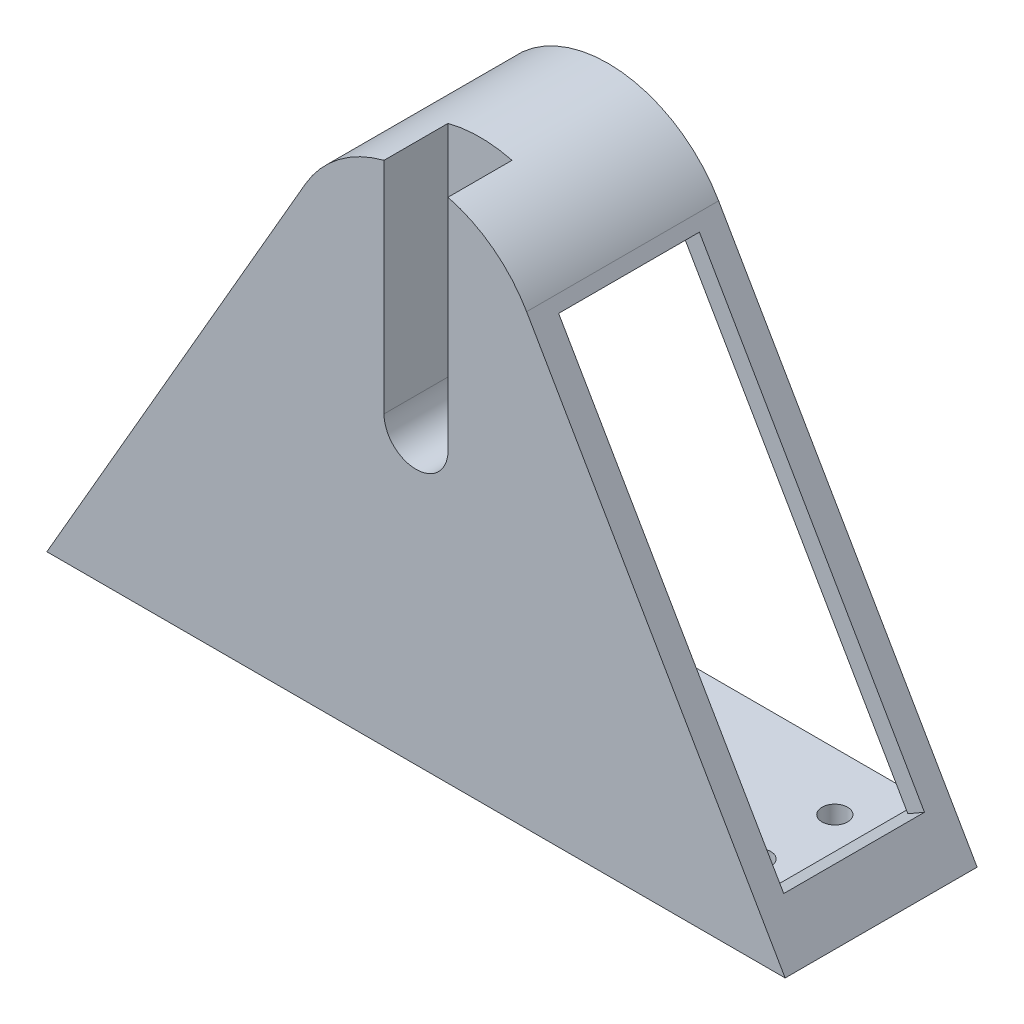
ISO-10303-21;
HEADER;
FILE_DESCRIPTION(('STEP AP214'),'2;1');
FILE_NAME('part.step','',(''),(''),'','','');
FILE_SCHEMA(('AUTOMOTIVE_DESIGN { 1 0 10303 214 1 1 1 1 }'));
ENDSEC;
DATA;
#1=APPLICATION_CONTEXT('core data for automotive mechanical design processes');
#2=APPLICATION_PROTOCOL_DEFINITION('international standard','automotive_design',2000,#1);
#3=PRODUCT_CONTEXT('',#1,'mechanical');
#4=PRODUCT('Part','Part','',(#3));
#5=PRODUCT_RELATED_PRODUCT_CATEGORY('part','',(#4));
#6=PRODUCT_DEFINITION_FORMATION('','',#4);
#7=PRODUCT_DEFINITION_CONTEXT('part definition',#1,'design');
#8=PRODUCT_DEFINITION('design','',#6,#7);
#9=PRODUCT_DEFINITION_SHAPE('','',#8);
#10=(LENGTH_UNIT() NAMED_UNIT(*) SI_UNIT(.MILLI.,.METRE.));
#11=(NAMED_UNIT(*) PLANE_ANGLE_UNIT() SI_UNIT($,.RADIAN.));
#12=(NAMED_UNIT(*) SI_UNIT($,.STERADIAN.) SOLID_ANGLE_UNIT());
#13=UNCERTAINTY_MEASURE_WITH_UNIT(LENGTH_MEASURE(1.E-05),#10,'distance_accuracy_value','');
#14=(GEOMETRIC_REPRESENTATION_CONTEXT(3) GLOBAL_UNCERTAINTY_ASSIGNED_CONTEXT((#13)) GLOBAL_UNIT_ASSIGNED_CONTEXT((#10,
#11,#12)) REPRESENTATION_CONTEXT('',''));
#15=CARTESIAN_POINT('',(0.,0.,0.));
#16=DIRECTION('',(0.,0.,1.));
#17=DIRECTION('',(1.,0.,0.));
#18=AXIS2_PLACEMENT_3D('',#15,#16,#17);
#19=CARTESIAN_POINT('',(0.,65.,-122.8));
#20=DIRECTION('',(0.,-1.,0.));
#21=DIRECTION('',(0.,0.,-1.));
#22=AXIS2_PLACEMENT_3D('',#19,#20,#21);
#23=PLANE('',#22);
#24=CARTESIAN_POINT('',(144.450852961086,65.,-139.8));
#25=DIRECTION('',(0.,1.,0.));
#26=DIRECTION('',(0.,0.,1.));
#27=AXIS2_PLACEMENT_3D('',#24,#25,#26);
#28=CIRCLE('',#27,2.);
#29=CARTESIAN_POINT('',(144.450852961086,65.,-137.8));
#30=VERTEX_POINT('',#29);
#31=EDGE_CURVE('E276',#30,#30,#28,.T.);
#32=ORIENTED_EDGE('',*,*,#31,.F.);
#33=EDGE_LOOP('',(#32));
#34=FACE_BOUND('',#33,.T.);
#35=CARTESIAN_POINT('',(144.450852961086,65.,-127.8));
#36=DIRECTION('',(0.,1.,0.));
#37=DIRECTION('',(0.,0.,1.));
#38=AXIS2_PLACEMENT_3D('',#35,#36,#37);
#39=CIRCLE('',#38,2.);
#40=CARTESIAN_POINT('',(144.450852961086,65.,-125.8));
#41=VERTEX_POINT('',#40);
#42=EDGE_CURVE('E262',#41,#41,#39,.T.);
#43=ORIENTED_EDGE('',*,*,#42,.F.);
#44=EDGE_LOOP('',(#43));
#45=FACE_BOUND('',#44,.T.);
#46=CARTESIAN_POINT('',(55.4902217167998,65.,-127.8));
#47=DIRECTION('',(0.,1.,0.));
#48=DIRECTION('',(0.,0.,1.));
#49=AXIS2_PLACEMENT_3D('',#46,#47,#48);
#50=CIRCLE('',#49,2.);
#51=CARTESIAN_POINT('',(55.4902217167998,65.,-125.8));
#52=VERTEX_POINT('',#51);
#53=EDGE_CURVE('E261',#52,#52,#50,.T.);
#54=ORIENTED_EDGE('',*,*,#53,.F.);
#55=EDGE_LOOP('',(#54));
#56=FACE_BOUND('',#55,.T.);
#57=CARTESIAN_POINT('',(55.4902217167998,65.,-139.8));
#58=DIRECTION('',(0.,1.,0.));
#59=DIRECTION('',(0.,0.,1.));
#60=AXIS2_PLACEMENT_3D('',#57,#58,#59);
#61=CIRCLE('',#60,2.);
#62=CARTESIAN_POINT('',(55.4902217167998,65.,-137.8));
#63=VERTEX_POINT('',#62);
#64=EDGE_CURVE('E282',#63,#63,#61,.T.);
#65=ORIENTED_EDGE('',*,*,#64,.F.);
#66=EDGE_LOOP('',(#65));
#67=FACE_BOUND('',#66,.T.);
#68=DIRECTION('',(0.,0.,1.));
#69=VECTOR('',#68,1.);
#70=CARTESIAN_POINT('',(149.450852961086,65.,-148.8));
#71=LINE('',#70,#69);
#72=CARTESIAN_POINT('',(149.450852961086,65.,-148.8));
#73=VERTEX_POINT('',#72);
#74=CARTESIAN_POINT('',(149.450852961086,65.,-122.8));
#75=VERTEX_POINT('',#74);
#76=EDGE_CURVE('E233',#73,#75,#71,.T.);
#77=ORIENTED_EDGE('',*,*,#76,.F.);
#78=DIRECTION('',(-1.,0.,0.));
#79=VECTOR('',#78,1.);
#80=CARTESIAN_POINT('',(0.,65.,-148.8));
#81=LINE('',#80,#79);
#82=CARTESIAN_POINT('',(50.4902217167998,65.,-148.8));
#83=VERTEX_POINT('',#82);
#84=EDGE_CURVE('E290',#73,#83,#81,.T.);
#85=ORIENTED_EDGE('',*,*,#84,.T.);
#86=DIRECTION('',(0.,0.,1.));
#87=VECTOR('',#86,1.);
#88=CARTESIAN_POINT('',(50.4902217167998,65.,-148.8));
#89=LINE('',#88,#87);
#90=CARTESIAN_POINT('',(50.4902217167998,65.,-122.8));
#91=VERTEX_POINT('',#90);
#92=EDGE_CURVE('E236',#83,#91,#89,.T.);
#93=ORIENTED_EDGE('',*,*,#92,.T.);
#94=DIRECTION('',(-1.,0.,0.));
#95=VECTOR('',#94,1.);
#96=CARTESIAN_POINT('',(0.,65.,-122.8));
#97=LINE('',#96,#95);
#98=EDGE_CURVE('E219',#75,#91,#97,.T.);
#99=ORIENTED_EDGE('',*,*,#98,.F.);
#100=EDGE_LOOP('',(#77,#85,#93,#99));
#101=FACE_BOUND('',#100,.T.);
#102=ADVANCED_FACE('F40',(#34,#45,#56,#67,#101),#23,.F.);
#103=CARTESIAN_POINT('',(0.,0.,-122.8));
#104=DIRECTION('',(0.,0.,-1.));
#105=DIRECTION('',(-1.,0.,0.));
#106=AXIS2_PLACEMENT_3D('',#103,#104,#105);
#107=PLANE('',#106);
#108=DIRECTION('',(0.866025403784436,0.500000000000004,0.));
#109=VECTOR('',#108,1.);
#110=CARTESIAN_POINT('',(150.001497308104,65.3179146619785,-122.8));
#111=LINE('',#110,#109);
#112=CARTESIAN_POINT('',(153.465598923241,67.3179146619785,-122.8));
#113=VERTEX_POINT('',#112);
#114=EDGE_CURVE('E215',#75,#113,#111,.T.);
#115=ORIENTED_EDGE('',*,*,#114,.F.);
#116=ORIENTED_EDGE('',*,*,#98,.T.);
#117=DIRECTION('',(-0.86602540378444,0.499999999999998,0.));
#118=VECTOR('',#117,1.);
#119=CARTESIAN_POINT('',(49.9837713613677,65.2923992490399,-122.8));
#120=LINE('',#119,#118);
#121=CARTESIAN_POINT('',(46.5196697462299,67.2923992490399,-122.8));
#122=VERTEX_POINT('',#121);
#123=EDGE_CURVE('E238',#91,#122,#120,.T.);
#124=ORIENTED_EDGE('',*,*,#123,.T.);
#125=DIRECTION('',(-0.499999999999998,-0.86602540378444,0.));
#126=VECTOR('',#125,1.);
#127=CARTESIAN_POINT('',(5.7512886940359,-3.32050807568886,-122.8));
#128=LINE('',#127,#126);
#129=CARTESIAN_POINT('',(80.7128129211017,126.516660498395,-122.8));
#130=VERTEX_POINT('',#129);
#131=EDGE_CURVE('E418',#130,#122,#128,.T.);
#132=ORIENTED_EDGE('',*,*,#131,.F.);
#133=DIRECTION('',(-0.86602540378444,0.499999999999998,0.));
#134=VECTOR('',#133,1.);
#135=CARTESIAN_POINT('',(84.1769145362396,124.516660498395,-122.8));
#136=LINE('',#135,#134);
#137=CARTESIAN_POINT('',(83.3108891324551,125.016660498395,-122.8));
#138=VERTEX_POINT('',#137);
#139=EDGE_CURVE('E347',#138,#130,#136,.T.);
#140=ORIENTED_EDGE('',*,*,#139,.F.);
#141=DIRECTION('',(0.499999999999998,0.86602540378444,0.));
#142=VECTOR('',#141,1.);
#143=CARTESIAN_POINT('',(8.34936490538919,-4.82050807568884,-122.8));
#144=LINE('',#143,#142);
#145=CARTESIAN_POINT('',(85.3108891324551,128.480762113533,-122.8));
#146=VERTEX_POINT('',#145);
#147=EDGE_CURVE('E381',#138,#146,#144,.T.);
#148=ORIENTED_EDGE('',*,*,#147,.T.);
#149=CARTESIAN_POINT('',(99.9999999999996,120.,-122.8));
#150=DIRECTION('',(0.,0.,-1.));
#151=DIRECTION('',(-1.,0.,0.));
#152=AXIS2_PLACEMENT_3D('',#149,#150,#151);
#153=CIRCLE('',#152,16.9615242270662);
#154=CARTESIAN_POINT('',(90.,133.700120587256,-122.8));
#155=VERTEX_POINT('',#154);
#156=EDGE_CURVE('E376',#146,#155,#153,.T.);
#157=ORIENTED_EDGE('',*,*,#156,.T.);
#158=DIRECTION('',(0.823883853054496,0.566758675871907,0.));
#159=VECTOR('',#158,1.);
#160=CARTESIAN_POINT('',(90.,133.700120587256,-122.8));
#161=LINE('',#160,#159);
#162=CARTESIAN_POINT('',(93.,135.763853261846,-122.8));
#163=VERTEX_POINT('',#162);
#164=EDGE_CURVE('E380',#155,#163,#161,.T.);
#165=ORIENTED_EDGE('',*,*,#164,.T.);
#166=DIRECTION('',(0.,-1.,0.));
#167=VECTOR('',#166,1.);
#168=CARTESIAN_POINT('',(93.,105.,-122.8));
#169=LINE('',#168,#167);
#170=CARTESIAN_POINT('',(93.,105.,-122.8));
#171=VERTEX_POINT('',#170);
#172=EDGE_CURVE('E484',#163,#171,#169,.T.);
#173=ORIENTED_EDGE('',*,*,#172,.T.);
#174=CARTESIAN_POINT('',(100.,105.,-122.8));
#175=DIRECTION('',(0.,0.,1.));
#176=DIRECTION('',(-1.,0.,0.));
#177=AXIS2_PLACEMENT_3D('',#174,#175,#176);
#178=CIRCLE('',#177,7.00000000000001);
#179=CARTESIAN_POINT('',(107.,105.,-122.8));
#180=VERTEX_POINT('',#179);
#181=EDGE_CURVE('E492',#171,#180,#178,.T.);
#182=ORIENTED_EDGE('',*,*,#181,.T.);
#183=DIRECTION('',(0.,1.,0.));
#184=VECTOR('',#183,1.);
#185=CARTESIAN_POINT('',(107.,105.,-122.8));
#186=LINE('',#185,#184);
#187=CARTESIAN_POINT('',(107.,135.763853261846,-122.8));
#188=VERTEX_POINT('',#187);
#189=EDGE_CURVE('E488',#180,#188,#186,.T.);
#190=ORIENTED_EDGE('',*,*,#189,.T.);
#191=DIRECTION('',(0.823883853054429,-0.566758675872005,0.));
#192=VECTOR('',#191,1.);
#193=CARTESIAN_POINT('',(110.,133.700120587256,-122.8));
#194=LINE('',#193,#192);
#195=CARTESIAN_POINT('',(110.,133.700120587256,-122.8));
#196=VERTEX_POINT('',#195);
#197=EDGE_CURVE('E393',#188,#196,#194,.T.);
#198=ORIENTED_EDGE('',*,*,#197,.T.);
#199=CARTESIAN_POINT('',(99.9999999999996,120.,-122.8));
#200=DIRECTION('',(0.,0.,-1.));
#201=DIRECTION('',(-1.,0.,0.));
#202=AXIS2_PLACEMENT_3D('',#199,#200,#201);
#203=CIRCLE('',#202,16.9615242270662);
#204=CARTESIAN_POINT('',(114.689110867544,128.480762113533,-122.8));
#205=VERTEX_POINT('',#204);
#206=EDGE_CURVE('E389',#196,#205,#203,.T.);
#207=ORIENTED_EDGE('',*,*,#206,.T.);
#208=DIRECTION('',(0.500000000000004,-0.866025403784436,0.));
#209=VECTOR('',#208,1.);
#210=CARTESIAN_POINT('',(141.65063509461,81.7820323027557,-122.8));
#211=LINE('',#210,#209);
#212=CARTESIAN_POINT('',(115.689110867544,126.748711305964,-122.8));
#213=VERTEX_POINT('',#212);
#214=EDGE_CURVE('E384',#205,#213,#211,.T.);
#215=ORIENTED_EDGE('',*,*,#214,.T.);
#216=DIRECTION('',(0.866025403784436,0.500000000000004,0.));
#217=VECTOR('',#216,1.);
#218=CARTESIAN_POINT('',(114.82308546376,126.248711305964,-122.8));
#219=LINE('',#218,#217);
#220=CARTESIAN_POINT('',(118.287187078897,128.248711305964,-122.8));
#221=VERTEX_POINT('',#220);
#222=EDGE_CURVE('E388',#213,#221,#219,.T.);
#223=ORIENTED_EDGE('',*,*,#222,.T.);
#224=DIRECTION('',(0.500000000000004,-0.866025403784436,0.));
#225=VECTOR('',#224,1.);
#226=CARTESIAN_POINT('',(118.287187078897,128.248711305964,-122.8));
#227=LINE('',#226,#225);
#228=EDGE_CURVE('E222',#221,#113,#227,.T.);
#229=ORIENTED_EDGE('',*,*,#228,.T.);
#230=EDGE_LOOP('',(#115,#116,#124,#132,#140,#148,#157,#165,#173,#182,#190,#198,#207,#215,#223,#229));
#231=FACE_BOUND('',#230,.T.);
#232=ADVANCED_FACE('F217',(#231),#107,.T.);
#233=CARTESIAN_POINT('',(141.65063509461,81.7820323027557,-122.8));
#234=DIRECTION('',(0.866025403784436,0.500000000000004,0.));
#235=DIRECTION('',(-0.500000000000004,0.866025403784436,0.));
#236=AXIS2_PLACEMENT_3D('',#233,#234,#235);
#237=PLANE('',#236);
#238=DIRECTION('',(0.,0.,1.));
#239=VECTOR('',#238,1.);
#240=CARTESIAN_POINT('',(150.867522711888,65.8179146619785,-148.8));
#241=LINE('',#240,#239);
#242=CARTESIAN_POINT('',(150.867522711888,65.8179146619785,-148.8));
#243=VERTEX_POINT('',#242);
#244=CARTESIAN_POINT('',(150.867522711888,65.8179146619785,-144.8));
#245=VERTEX_POINT('',#244);
#246=EDGE_CURVE('E253',#243,#245,#241,.T.);
#247=ORIENTED_EDGE('',*,*,#246,.T.);
#248=DIRECTION('',(-0.500000000000004,0.866025403784436,0.));
#249=VECTOR('',#248,1.);
#250=CARTESIAN_POINT('',(141.65063509461,81.7820323027557,-144.8));
#251=LINE('',#250,#249);
#252=CARTESIAN_POINT('',(115.689110867544,126.748711305964,-144.8));
#253=VERTEX_POINT('',#252);
#254=EDGE_CURVE('E532',#245,#253,#251,.T.);
#255=ORIENTED_EDGE('',*,*,#254,.T.);
#256=DIRECTION('',(0.,0.,1.));
#257=VECTOR('',#256,1.);
#258=CARTESIAN_POINT('',(115.689110867544,126.748711305964,-122.8));
#259=LINE('',#258,#257);
#260=EDGE_CURVE('E353',#253,#213,#259,.T.);
#261=ORIENTED_EDGE('',*,*,#260,.T.);
#262=ORIENTED_EDGE('',*,*,#214,.F.);
#263=DIRECTION('',(0.,0.,-1.));
#264=VECTOR('',#263,1.);
#265=CARTESIAN_POINT('',(114.689110867544,128.480762113533,-122.8));
#266=LINE('',#265,#264);
#267=CARTESIAN_POINT('',(114.689110867544,128.480762113533,-148.8));
#268=VERTEX_POINT('',#267);
#269=EDGE_CURVE('E349',#205,#268,#266,.T.);
#270=ORIENTED_EDGE('',*,*,#269,.T.);
#271=DIRECTION('',(0.500000000000004,-0.866025403784436,0.));
#272=VECTOR('',#271,1.);
#273=CARTESIAN_POINT('',(141.65063509461,81.7820323027557,-148.8));
#274=LINE('',#273,#272);
#275=EDGE_CURVE('E352',#268,#243,#274,.T.);
#276=ORIENTED_EDGE('',*,*,#275,.T.);
#277=EDGE_LOOP('',(#247,#255,#261,#262,#270,#276));
#278=FACE_BOUND('',#277,.T.);
#279=ADVANCED_FACE('F553',(#278),#237,.F.);
#280=CARTESIAN_POINT('',(8.34936490538919,-4.82050807568884,-122.8));
#281=DIRECTION('',(-0.86602540378444,0.499999999999998,0.));
#282=DIRECTION('',(-0.499999999999998,-0.86602540378444,0.));
#283=AXIS2_PLACEMENT_3D('',#280,#281,#282);
#284=PLANE('',#283);
#285=DIRECTION('',(0.,0.,1.));
#286=VECTOR('',#285,1.);
#287=CARTESIAN_POINT('',(49.1177459575832,65.7923992490399,-148.8));
#288=LINE('',#287,#286);
#289=CARTESIAN_POINT('',(49.1177459575832,65.7923992490399,-148.8));
#290=VERTEX_POINT('',#289);
#291=CARTESIAN_POINT('',(49.1177459575832,65.7923992490399,-144.8));
#292=VERTEX_POINT('',#291);
#293=EDGE_CURVE('E448',#290,#292,#288,.T.);
#294=ORIENTED_EDGE('',*,*,#293,.F.);
#295=DIRECTION('',(0.499999999999998,0.86602540378444,0.));
#296=VECTOR('',#295,1.);
#297=CARTESIAN_POINT('',(8.34936490538919,-4.82050807568884,-148.8));
#298=LINE('',#297,#296);
#299=CARTESIAN_POINT('',(85.3108891324551,128.480762113533,-148.8));
#300=VERTEX_POINT('',#299);
#301=EDGE_CURVE('E366',#290,#300,#298,.T.);
#302=ORIENTED_EDGE('',*,*,#301,.T.);
#303=DIRECTION('',(0.,0.,-1.));
#304=VECTOR('',#303,1.);
#305=CARTESIAN_POINT('',(85.3108891324551,128.480762113533,-122.8));
#306=LINE('',#305,#304);
#307=EDGE_CURVE('E354',#146,#300,#306,.T.);
#308=ORIENTED_EDGE('',*,*,#307,.F.);
#309=ORIENTED_EDGE('',*,*,#147,.F.);
#310=DIRECTION('',(0.,0.,-1.));
#311=VECTOR('',#310,1.);
#312=CARTESIAN_POINT('',(83.3108891324551,125.016660498395,-122.8));
#313=LINE('',#312,#311);
#314=CARTESIAN_POINT('',(83.3108891324551,125.016660498395,-144.8));
#315=VERTEX_POINT('',#314);
#316=EDGE_CURVE('E308',#138,#315,#313,.T.);
#317=ORIENTED_EDGE('',*,*,#316,.T.);
#318=DIRECTION('',(-0.499999999999998,-0.86602540378444,0.));
#319=VECTOR('',#318,1.);
#320=CARTESIAN_POINT('',(8.34936490538919,-4.82050807568884,-144.8));
#321=LINE('',#320,#319);
#322=EDGE_CURVE('E257',#315,#292,#321,.T.);
#323=ORIENTED_EDGE('',*,*,#322,.T.);
#324=EDGE_LOOP('',(#294,#302,#308,#309,#317,#323));
#325=FACE_BOUND('',#324,.T.);
#326=ADVANCED_FACE('F586',(#325),#284,.F.);
#327=CARTESIAN_POINT('',(99.9999999999996,120.,-148.8));
#328=DIRECTION('',(0.,0.,1.));
#329=DIRECTION('',(1.,0.,0.));
#330=AXIS2_PLACEMENT_3D('',#327,#328,#329);
#331=PLANE('',#330);
#332=ORIENTED_EDGE('',*,*,#84,.F.);
#333=DIRECTION('',(0.866025403784424,0.500000000000025,0.));
#334=VECTOR('',#333,1.);
#335=CARTESIAN_POINT('',(150.867522711888,65.8179146619785,-148.8));
#336=LINE('',#335,#334);
#337=EDGE_CURVE('E244',#73,#243,#336,.T.);
#338=ORIENTED_EDGE('',*,*,#337,.T.);
#339=ORIENTED_EDGE('',*,*,#275,.F.);
#340=CARTESIAN_POINT('',(99.9999999999996,120.,-148.8));
#341=DIRECTION('',(0.,0.,-1.));
#342=DIRECTION('',(-1.,0.,0.));
#343=AXIS2_PLACEMENT_3D('',#340,#341,#342);
#344=CIRCLE('',#343,16.9615242270662);
#345=CARTESIAN_POINT('',(110.,133.700120587256,-148.8));
#346=VERTEX_POINT('',#345);
#347=EDGE_CURVE('E348',#346,#268,#344,.T.);
#348=ORIENTED_EDGE('',*,*,#347,.F.);
#349=DIRECTION('',(0.823883853054429,-0.566758675872005,0.));
#350=VECTOR('',#349,1.);
#351=CARTESIAN_POINT('',(110.,133.700120587256,-148.8));
#352=LINE('',#351,#350);
#353=CARTESIAN_POINT('',(107.,135.763853261846,-148.8));
#354=VERTEX_POINT('',#353);
#355=EDGE_CURVE('E361',#354,#346,#352,.T.);
#356=ORIENTED_EDGE('',*,*,#355,.F.);
#357=CARTESIAN_POINT('',(99.9999999999996,120.,-148.8));
#358=DIRECTION('',(0.,0.,-1.));
#359=DIRECTION('',(1.,0.,0.));
#360=AXIS2_PLACEMENT_3D('',#357,#358,#359);
#361=CIRCLE('',#360,17.2481613414596);
#362=CARTESIAN_POINT('',(93.,135.763853261846,-148.8));
#363=VERTEX_POINT('',#362);
#364=EDGE_CURVE('E463',#363,#354,#361,.T.);
#365=ORIENTED_EDGE('',*,*,#364,.F.);
#366=DIRECTION('',(0.823883853054496,0.566758675871907,0.));
#367=VECTOR('',#366,1.);
#368=CARTESIAN_POINT('',(90.,133.700120587256,-148.8));
#369=LINE('',#368,#367);
#370=CARTESIAN_POINT('',(90.,133.700120587256,-148.8));
#371=VERTEX_POINT('',#370);
#372=EDGE_CURVE('E362',#371,#363,#369,.T.);
#373=ORIENTED_EDGE('',*,*,#372,.F.);
#374=CARTESIAN_POINT('',(99.9999999999996,120.,-148.8));
#375=DIRECTION('',(0.,0.,-1.));
#376=DIRECTION('',(-1.,0.,0.));
#377=AXIS2_PLACEMENT_3D('',#374,#375,#376);
#378=CIRCLE('',#377,16.9615242270662);
#379=EDGE_CURVE('E318',#300,#371,#378,.T.);
#380=ORIENTED_EDGE('',*,*,#379,.F.);
#381=ORIENTED_EDGE('',*,*,#301,.F.);
#382=DIRECTION('',(0.866025403784442,-0.499999999999994,0.));
#383=VECTOR('',#382,1.);
#384=CARTESIAN_POINT('',(49.1177459575832,65.7923992490399,-148.8));
#385=LINE('',#384,#383);
#386=EDGE_CURVE('E256',#290,#83,#385,.T.);
#387=ORIENTED_EDGE('',*,*,#386,.T.);
#388=EDGE_LOOP('',(#332,#338,#339,#348,#356,#365,#373,#380,#381,#387));
#389=FACE_BOUND('',#388,.T.);
#390=DIRECTION('',(0.500000000000005,-0.866025403784436,0.));
#391=VECTOR('',#390,1.);
#392=CARTESIAN_POINT('',(117.287187078897,129.980762113533,-148.8));
#393=LINE('',#392,#391);
#394=CARTESIAN_POINT('',(117.287187078897,129.980762113533,-148.8));
#395=VERTEX_POINT('',#394);
#396=CARTESIAN_POINT('',(157.690598923241,60.,-148.8));
#397=VERTEX_POINT('',#396);
#398=EDGE_CURVE('E295',#395,#397,#393,.T.);
#399=ORIENTED_EDGE('',*,*,#398,.T.);
#400=DIRECTION('',(-1.,0.,0.));
#401=VECTOR('',#400,1.);
#402=CARTESIAN_POINT('',(0.,60.,-148.8));
#403=LINE('',#402,#401);
#404=CARTESIAN_POINT('',(42.3094010767585,60.,-148.8));
#405=VERTEX_POINT('',#404);
#406=EDGE_CURVE('E291',#397,#405,#403,.T.);
#407=ORIENTED_EDGE('',*,*,#406,.T.);
#408=DIRECTION('',(0.499999999999998,0.86602540378444,0.));
#409=VECTOR('',#408,1.);
#410=CARTESIAN_POINT('',(82.7128129211017,129.980762113533,-148.8));
#411=LINE('',#410,#409);
#412=CARTESIAN_POINT('',(82.7128129211017,129.980762113533,-148.8));
#413=VERTEX_POINT('',#412);
#414=EDGE_CURVE('E294',#405,#413,#411,.T.);
#415=ORIENTED_EDGE('',*,*,#414,.T.);
#416=CARTESIAN_POINT('',(99.9999999999996,120.,-148.8));
#417=DIRECTION('',(0.,0.,1.));
#418=DIRECTION('',(1.,0.,0.));
#419=AXIS2_PLACEMENT_3D('',#416,#417,#418);
#420=CIRCLE('',#419,19.9615242270662);
#421=EDGE_CURVE('E332',#413,#395,#420,.F.);
#422=ORIENTED_EDGE('',*,*,#421,.T.);
#423=EDGE_LOOP('',(#399,#407,#415,#422));
#424=FACE_BOUND('',#423,.T.);
#425=ADVANCED_FACE('F571',(#389,#424),#331,.F.);
#426=CARTESIAN_POINT('',(99.9999999999996,120.,-118.8));
#427=DIRECTION('',(0.,0.,1.));
#428=DIRECTION('',(1.,0.,0.));
#429=AXIS2_PLACEMENT_3D('',#426,#427,#428);
#430=PLANE('',#429);
#431=DIRECTION('',(-1.,0.,0.));
#432=VECTOR('',#431,1.);
#433=CARTESIAN_POINT('',(0.,60.,-118.8));
#434=LINE('',#433,#432);
#435=CARTESIAN_POINT('',(157.690598923241,60.,-118.8));
#436=VERTEX_POINT('',#435);
#437=CARTESIAN_POINT('',(42.3094010767585,60.,-118.8));
#438=VERTEX_POINT('',#437);
#439=EDGE_CURVE('E11',#436,#438,#434,.T.);
#440=ORIENTED_EDGE('',*,*,#439,.F.);
#441=DIRECTION('',(0.500000000000005,-0.866025403784436,0.));
#442=VECTOR('',#441,1.);
#443=CARTESIAN_POINT('',(117.287187078897,129.980762113533,-118.8));
#444=LINE('',#443,#442);
#445=CARTESIAN_POINT('',(117.287187078897,129.980762113533,-118.8));
#446=VERTEX_POINT('',#445);
#447=EDGE_CURVE('E413',#446,#436,#444,.T.);
#448=ORIENTED_EDGE('',*,*,#447,.F.);
#449=CARTESIAN_POINT('',(99.9999999999996,120.,-118.8));
#450=DIRECTION('',(0.,0.,1.));
#451=DIRECTION('',(1.,0.,0.));
#452=AXIS2_PLACEMENT_3D('',#449,#450,#451);
#453=CIRCLE('',#452,19.9615242270662);
#454=CARTESIAN_POINT('',(105.,139.325176570157,-118.8));
#455=VERTEX_POINT('',#454);
#456=EDGE_CURVE('E303',#455,#446,#453,.F.);
#457=ORIENTED_EDGE('',*,*,#456,.F.);
#458=DIRECTION('',(0.,1.,0.));
#459=VECTOR('',#458,1.);
#460=CARTESIAN_POINT('',(105.,0.,-118.8));
#461=LINE('',#460,#459);
#462=CARTESIAN_POINT('',(105.,105.,-118.8));
#463=VERTEX_POINT('',#462);
#464=EDGE_CURVE('E313',#463,#455,#461,.T.);
#465=ORIENTED_EDGE('',*,*,#464,.F.);
#466=CARTESIAN_POINT('',(100.,105.,-118.8));
#467=DIRECTION('',(0.,0.,1.));
#468=DIRECTION('',(1.,0.,0.));
#469=AXIS2_PLACEMENT_3D('',#466,#467,#468);
#470=CIRCLE('',#469,5.00000000000001);
#471=CARTESIAN_POINT('',(95.,105.,-118.8));
#472=VERTEX_POINT('',#471);
#473=EDGE_CURVE('E314',#472,#463,#470,.T.);
#474=ORIENTED_EDGE('',*,*,#473,.F.);
#475=DIRECTION('',(0.,1.,0.));
#476=VECTOR('',#475,1.);
#477=CARTESIAN_POINT('',(95.,0.,-118.8));
#478=LINE('',#477,#476);
#479=CARTESIAN_POINT('',(95.,139.325176570157,-118.8));
#480=VERTEX_POINT('',#479);
#481=EDGE_CURVE('E327',#472,#480,#478,.T.);
#482=ORIENTED_EDGE('',*,*,#481,.T.);
#483=CARTESIAN_POINT('',(82.7128129211017,129.980762113533,-118.8));
#484=VERTEX_POINT('',#483);
#485=EDGE_CURVE('E425',#484,#480,#453,.F.);
#486=ORIENTED_EDGE('',*,*,#485,.F.);
#487=DIRECTION('',(0.499999999999998,0.86602540378444,0.));
#488=VECTOR('',#487,1.);
#489=CARTESIAN_POINT('',(82.7128129211017,129.980762113533,-118.8));
#490=LINE('',#489,#488);
#491=EDGE_CURVE('E424',#438,#484,#490,.T.);
#492=ORIENTED_EDGE('',*,*,#491,.F.);
#493=EDGE_LOOP('',(#440,#448,#457,#465,#474,#482,#486,#492));
#494=FACE_BOUND('',#493,.T.);
#495=ADVANCED_FACE('F669',(#494),#430,.T.);
#496=CARTESIAN_POINT('',(0.,0.,-128.8));
#497=DIRECTION('',(0.,0.,1.));
#498=DIRECTION('',(1.,0.,0.));
#499=AXIS2_PLACEMENT_3D('',#496,#497,#498);
#500=PLANE('',#499);
#501=CARTESIAN_POINT('',(99.9999999999996,120.,-128.8));
#502=DIRECTION('',(0.,0.,1.));
#503=DIRECTION('',(1.,0.,0.));
#504=AXIS2_PLACEMENT_3D('',#501,#502,#503);
#505=CIRCLE('',#504,19.9615242270662);
#506=CARTESIAN_POINT('',(95.,139.325176570157,-128.8));
#507=VERTEX_POINT('',#506);
#508=CARTESIAN_POINT('',(105.,139.325176570157,-128.8));
#509=VERTEX_POINT('',#508);
#510=EDGE_CURVE('E300',#507,#509,#505,.F.);
#511=ORIENTED_EDGE('',*,*,#510,.F.);
#512=DIRECTION('',(0.,1.,0.));
#513=VECTOR('',#512,1.);
#514=CARTESIAN_POINT('',(95.,0.,-128.8));
#515=LINE('',#514,#513);
#516=CARTESIAN_POINT('',(95.,105.,-128.8));
#517=VERTEX_POINT('',#516);
#518=EDGE_CURVE('E326',#517,#507,#515,.T.);
#519=ORIENTED_EDGE('',*,*,#518,.F.);
#520=CARTESIAN_POINT('',(100.,105.,-128.8));
#521=DIRECTION('',(0.,0.,1.));
#522=DIRECTION('',(1.,0.,0.));
#523=AXIS2_PLACEMENT_3D('',#520,#521,#522);
#524=CIRCLE('',#523,5.00000000000001);
#525=CARTESIAN_POINT('',(105.,105.,-128.8));
#526=VERTEX_POINT('',#525);
#527=EDGE_CURVE('E331',#517,#526,#524,.T.);
#528=ORIENTED_EDGE('',*,*,#527,.T.);
#529=DIRECTION('',(0.,1.,0.));
#530=VECTOR('',#529,1.);
#531=CARTESIAN_POINT('',(105.,0.,-128.8));
#532=LINE('',#531,#530);
#533=EDGE_CURVE('E333',#526,#509,#532,.T.);
#534=ORIENTED_EDGE('',*,*,#533,.T.);
#535=EDGE_LOOP('',(#511,#519,#528,#534));
#536=FACE_BOUND('',#535,.T.);
#537=ADVANCED_FACE('F682',(#536),#500,.T.);
#538=CARTESIAN_POINT('',(95.,0.,-128.8));
#539=DIRECTION('',(1.,0.,0.));
#540=DIRECTION('',(0.,0.,-1.));
#541=AXIS2_PLACEMENT_3D('',#538,#539,#540);
#542=PLANE('',#541);
#543=DIRECTION('',(0.,0.,1.));
#544=VECTOR('',#543,1.);
#545=CARTESIAN_POINT('',(95.,139.325176570157,-188.));
#546=LINE('',#545,#544);
#547=EDGE_CURVE('E304',#480,#507,#546,.F.);
#548=ORIENTED_EDGE('',*,*,#547,.F.);
#549=ORIENTED_EDGE('',*,*,#481,.F.);
#550=DIRECTION('',(0.,0.,1.));
#551=VECTOR('',#550,1.);
#552=CARTESIAN_POINT('',(95.,105.,-128.8));
#553=LINE('',#552,#551);
#554=EDGE_CURVE('E309',#517,#472,#553,.T.);
#555=ORIENTED_EDGE('',*,*,#554,.F.);
#556=ORIENTED_EDGE('',*,*,#518,.T.);
#557=EDGE_LOOP('',(#548,#549,#555,#556));
#558=FACE_BOUND('',#557,.T.);
#559=ADVANCED_FACE('F674',(#558),#542,.T.);
#560=CARTESIAN_POINT('',(100.,105.,-128.8));
#561=DIRECTION('',(0.,0.,1.));
#562=DIRECTION('',(1.,0.,0.));
#563=AXIS2_PLACEMENT_3D('',#560,#561,#562);
#564=CYLINDRICAL_SURFACE('',#563,5.00000000000001);
#565=ORIENTED_EDGE('',*,*,#473,.T.);
#566=DIRECTION('',(0.,0.,1.));
#567=VECTOR('',#566,1.);
#568=CARTESIAN_POINT('',(105.,105.,-128.8));
#569=LINE('',#568,#567);
#570=EDGE_CURVE('E315',#526,#463,#569,.T.);
#571=ORIENTED_EDGE('',*,*,#570,.F.);
#572=ORIENTED_EDGE('',*,*,#527,.F.);
#573=ORIENTED_EDGE('',*,*,#554,.T.);
#574=EDGE_LOOP('',(#565,#571,#572,#573));
#575=FACE_BOUND('',#574,.T.);
#576=ADVANCED_FACE('F678',(#575),#564,.F.);
#577=CARTESIAN_POINT('',(105.,0.,-128.8));
#578=DIRECTION('',(1.,0.,0.));
#579=DIRECTION('',(0.,0.,-1.));
#580=AXIS2_PLACEMENT_3D('',#577,#578,#579);
#581=PLANE('',#580);
#582=ORIENTED_EDGE('',*,*,#464,.T.);
#583=DIRECTION('',(0.,0.,1.));
#584=VECTOR('',#583,1.);
#585=CARTESIAN_POINT('',(105.,139.325176570157,-188.));
#586=LINE('',#585,#584);
#587=EDGE_CURVE('E319',#455,#509,#586,.F.);
#588=ORIENTED_EDGE('',*,*,#587,.T.);
#589=ORIENTED_EDGE('',*,*,#533,.F.);
#590=ORIENTED_EDGE('',*,*,#570,.T.);
#591=EDGE_LOOP('',(#582,#588,#589,#590));
#592=FACE_BOUND('',#591,.T.);
#593=ADVANCED_FACE('F644',(#592),#581,.F.);
#594=CARTESIAN_POINT('',(99.9999999999996,120.,-122.8));
#595=DIRECTION('',(0.,0.,-1.));
#596=DIRECTION('',(-1.,0.,0.));
#597=AXIS2_PLACEMENT_3D('',#594,#595,#596);
#598=CYLINDRICAL_SURFACE('',#597,16.9615242270662);
#599=ORIENTED_EDGE('',*,*,#379,.T.);
#600=DIRECTION('',(0.,0.,-1.));
#601=VECTOR('',#600,1.);
#602=CARTESIAN_POINT('',(90.,133.700120587256,-122.8));
#603=LINE('',#602,#601);
#604=EDGE_CURVE('E358',#155,#371,#603,.T.);
#605=ORIENTED_EDGE('',*,*,#604,.F.);
#606=ORIENTED_EDGE('',*,*,#156,.F.);
#607=ORIENTED_EDGE('',*,*,#307,.T.);
#608=EDGE_LOOP('',(#599,#605,#606,#607));
#609=FACE_BOUND('',#608,.T.);
#610=ADVANCED_FACE('F591',(#609),#598,.F.);
#611=CARTESIAN_POINT('',(99.9999999999996,120.,-122.8));
#612=DIRECTION('',(0.,0.,-1.));
#613=DIRECTION('',(-1.,0.,0.));
#614=AXIS2_PLACEMENT_3D('',#611,#612,#613);
#615=CYLINDRICAL_SURFACE('',#614,16.9615242270662);
#616=ORIENTED_EDGE('',*,*,#347,.T.);
#617=ORIENTED_EDGE('',*,*,#269,.F.);
#618=ORIENTED_EDGE('',*,*,#206,.F.);
#619=DIRECTION('',(0.,0.,-1.));
#620=VECTOR('',#619,1.);
#621=CARTESIAN_POINT('',(110.,133.700120587256,-122.8));
#622=LINE('',#621,#620);
#623=EDGE_CURVE('E343',#196,#346,#622,.T.);
#624=ORIENTED_EDGE('',*,*,#623,.T.);
#625=EDGE_LOOP('',(#616,#617,#618,#624));
#626=FACE_BOUND('',#625,.T.);
#627=ADVANCED_FACE('F567',(#626),#615,.F.);
#628=CARTESIAN_POINT('',(84.1769145362396,124.516660498395,-122.8));
#629=DIRECTION('',(0.499999999999998,0.86602540378444,0.));
#630=DIRECTION('',(-0.86602540378444,0.499999999999998,0.));
#631=AXIS2_PLACEMENT_3D('',#628,#629,#630);
#632=PLANE('',#631);
#633=ORIENTED_EDGE('',*,*,#139,.T.);
#634=DIRECTION('',(0.,0.,-1.));
#635=VECTOR('',#634,1.);
#636=CARTESIAN_POINT('',(80.7128129211017,126.516660498395,-122.8));
#637=LINE('',#636,#635);
#638=CARTESIAN_POINT('',(80.7128129211017,126.516660498395,-144.8));
#639=VERTEX_POINT('',#638);
#640=EDGE_CURVE('E408',#130,#639,#637,.T.);
#641=ORIENTED_EDGE('',*,*,#640,.T.);
#642=DIRECTION('',(-0.86602540378444,0.499999999999998,0.));
#643=VECTOR('',#642,1.);
#644=CARTESIAN_POINT('',(84.1769145362396,124.516660498395,-144.8));
#645=LINE('',#644,#643);
#646=EDGE_CURVE('E409',#315,#639,#645,.T.);
#647=ORIENTED_EDGE('',*,*,#646,.F.);
#648=ORIENTED_EDGE('',*,*,#316,.F.);
#649=EDGE_LOOP('',(#633,#641,#647,#648));
#650=FACE_BOUND('',#649,.T.);
#651=ADVANCED_FACE('F583',(#650),#632,.F.);
#652=CARTESIAN_POINT('',(84.1769145362396,124.516660498395,-144.8));
#653=DIRECTION('',(0.,0.,-1.));
#654=DIRECTION('',(-1.,0.,0.));
#655=AXIS2_PLACEMENT_3D('',#652,#653,#654);
#656=PLANE('',#655);
#657=ORIENTED_EDGE('',*,*,#646,.T.);
#658=DIRECTION('',(-0.499999999999998,-0.86602540378444,0.));
#659=VECTOR('',#658,1.);
#660=CARTESIAN_POINT('',(80.7128129211017,126.516660498395,-144.8));
#661=LINE('',#660,#659);
#662=CARTESIAN_POINT('',(46.5196697462299,67.2923992490399,-144.8));
#663=VERTEX_POINT('',#662);
#664=EDGE_CURVE('E402',#639,#663,#661,.T.);
#665=ORIENTED_EDGE('',*,*,#664,.T.);
#666=DIRECTION('',(-0.86602540378444,0.499999999999998,0.));
#667=VECTOR('',#666,1.);
#668=CARTESIAN_POINT('',(49.9837713613677,65.2923992490399,-144.8));
#669=LINE('',#668,#667);
#670=EDGE_CURVE('E397',#292,#663,#669,.T.);
#671=ORIENTED_EDGE('',*,*,#670,.F.);
#672=ORIENTED_EDGE('',*,*,#322,.F.);
#673=EDGE_LOOP('',(#657,#665,#671,#672));
#674=FACE_BOUND('',#673,.T.);
#675=ADVANCED_FACE('F646',(#674),#656,.F.);
#676=CARTESIAN_POINT('',(49.9837713613677,65.2923992490399,-144.8));
#677=DIRECTION('',(-0.499999999999998,-0.86602540378444,0.));
#678=DIRECTION('',(0.86602540378444,-0.499999999999998,0.));
#679=AXIS2_PLACEMENT_3D('',#676,#677,#678);
#680=PLANE('',#679);
#681=ORIENTED_EDGE('',*,*,#670,.T.);
#682=DIRECTION('',(0.,0.,1.));
#683=VECTOR('',#682,1.);
#684=CARTESIAN_POINT('',(46.5196697462299,67.2923992490399,-144.8));
#685=LINE('',#684,#683);
#686=EDGE_CURVE('E401',#663,#122,#685,.T.);
#687=ORIENTED_EDGE('',*,*,#686,.T.);
#688=ORIENTED_EDGE('',*,*,#123,.F.);
#689=ORIENTED_EDGE('',*,*,#92,.F.);
#690=ORIENTED_EDGE('',*,*,#386,.F.);
#691=ORIENTED_EDGE('',*,*,#293,.T.);
#692=EDGE_LOOP('',(#681,#687,#688,#689,#690,#691));
#693=FACE_BOUND('',#692,.T.);
#694=ADVANCED_FACE('F577',(#693),#680,.F.);
#695=CARTESIAN_POINT('',(99.9999999999996,120.,-188.));
#696=DIRECTION('',(0.,0.,1.));
#697=DIRECTION('',(1.,0.,0.));
#698=AXIS2_PLACEMENT_3D('',#695,#696,#697);
#699=CYLINDRICAL_SURFACE('',#698,19.9615242270662);
#700=DIRECTION('',(0.,0.,1.));
#701=VECTOR('',#700,1.);
#702=CARTESIAN_POINT('',(82.7128129211017,129.980762113533,-188.));
#703=LINE('',#702,#701);
#704=EDGE_CURVE('E451',#413,#484,#703,.T.);
#705=ORIENTED_EDGE('',*,*,#704,.T.);
#706=ORIENTED_EDGE('',*,*,#485,.T.);
#707=ORIENTED_EDGE('',*,*,#547,.T.);
#708=ORIENTED_EDGE('',*,*,#510,.T.);
#709=ORIENTED_EDGE('',*,*,#587,.F.);
#710=ORIENTED_EDGE('',*,*,#456,.T.);
#711=DIRECTION('',(0.,0.,1.));
#712=VECTOR('',#711,1.);
#713=CARTESIAN_POINT('',(117.287187078897,129.980762113533,-188.));
#714=LINE('',#713,#712);
#715=EDGE_CURVE('E417',#395,#446,#714,.T.);
#716=ORIENTED_EDGE('',*,*,#715,.F.);
#717=ORIENTED_EDGE('',*,*,#421,.F.);
#718=EDGE_LOOP('',(#705,#706,#707,#708,#709,#710,#716,#717));
#719=FACE_BOUND('',#718,.T.);
#720=ADVANCED_FACE('F652',(#719),#699,.T.);
#721=CARTESIAN_POINT('',(82.7128129211017,129.980762113533,-188.));
#722=DIRECTION('',(0.86602540378444,-0.499999999999998,0.));
#723=DIRECTION('',(0.499999999999998,0.86602540378444,0.));
#724=AXIS2_PLACEMENT_3D('',#721,#722,#723);
#725=PLANE('',#724);
#726=ORIENTED_EDGE('',*,*,#491,.T.);
#727=ORIENTED_EDGE('',*,*,#704,.F.);
#728=ORIENTED_EDGE('',*,*,#414,.F.);
#729=DIRECTION('',(0.,0.,1.));
#730=VECTOR('',#729,1.);
#731=CARTESIAN_POINT('',(42.3094010767585,60.,-188.));
#732=LINE('',#731,#730);
#733=EDGE_CURVE('E433',#405,#438,#732,.T.);
#734=ORIENTED_EDGE('',*,*,#733,.T.);
#735=EDGE_LOOP('',(#726,#727,#728,#734));
#736=FACE_BOUND('',#735,.T.);
#737=ORIENTED_EDGE('',*,*,#131,.T.);
#738=ORIENTED_EDGE('',*,*,#686,.F.);
#739=ORIENTED_EDGE('',*,*,#664,.F.);
#740=ORIENTED_EDGE('',*,*,#640,.F.);
#741=EDGE_LOOP('',(#737,#738,#739,#740));
#742=FACE_BOUND('',#741,.T.);
#743=ADVANCED_FACE('F623',(#736,#742),#725,.F.);
#744=CARTESIAN_POINT('',(157.690598923241,60.,-188.));
#745=DIRECTION('',(-0.866025403784436,-0.500000000000004,0.));
#746=DIRECTION('',(0.500000000000005,-0.866025403784436,0.));
#747=AXIS2_PLACEMENT_3D('',#744,#745,#746);
#748=PLANE('',#747);
#749=DIRECTION('',(0.,0.,-1.));
#750=VECTOR('',#749,1.);
#751=CARTESIAN_POINT('',(153.465598923241,67.3179146619785,-122.8));
#752=LINE('',#751,#750);
#753=CARTESIAN_POINT('',(153.465598923241,67.3179146619785,-144.8));
#754=VERTEX_POINT('',#753);
#755=EDGE_CURVE('E228',#113,#754,#752,.T.);
#756=ORIENTED_EDGE('',*,*,#755,.F.);
#757=ORIENTED_EDGE('',*,*,#228,.F.);
#758=DIRECTION('',(0.,0.,1.));
#759=VECTOR('',#758,1.);
#760=CARTESIAN_POINT('',(118.287187078897,128.248711305964,-122.8));
#761=LINE('',#760,#759);
#762=CARTESIAN_POINT('',(118.287187078897,128.248711305964,-144.8));
#763=VERTEX_POINT('',#762);
#764=EDGE_CURVE('E539',#763,#221,#761,.T.);
#765=ORIENTED_EDGE('',*,*,#764,.F.);
#766=DIRECTION('',(-0.500000000000004,0.866025403784436,0.));
#767=VECTOR('',#766,1.);
#768=CARTESIAN_POINT('',(118.287187078897,128.248711305964,-144.8));
#769=LINE('',#768,#767);
#770=EDGE_CURVE('E229',#754,#763,#769,.T.);
#771=ORIENTED_EDGE('',*,*,#770,.F.);
#772=EDGE_LOOP('',(#756,#757,#765,#771));
#773=FACE_BOUND('',#772,.T.);
#774=ORIENTED_EDGE('',*,*,#447,.T.);
#775=DIRECTION('',(0.,0.,1.));
#776=VECTOR('',#775,1.);
#777=CARTESIAN_POINT('',(157.690598923241,60.,-188.));
#778=LINE('',#777,#776);
#779=EDGE_CURVE('E51',#397,#436,#778,.T.);
#780=ORIENTED_EDGE('',*,*,#779,.F.);
#781=ORIENTED_EDGE('',*,*,#398,.F.);
#782=ORIENTED_EDGE('',*,*,#715,.T.);
#783=EDGE_LOOP('',(#774,#780,#781,#782));
#784=FACE_BOUND('',#783,.T.);
#785=ADVANCED_FACE('F616',(#773,#784),#748,.F.);
#786=CARTESIAN_POINT('',(93.,105.,-122.8));
#787=DIRECTION('',(1.,0.,0.));
#788=DIRECTION('',(0.,0.,-1.));
#789=AXIS2_PLACEMENT_3D('',#786,#787,#788);
#790=PLANE('',#789);
#791=DIRECTION('',(0.,0.,-1.));
#792=VECTOR('',#791,1.);
#793=CARTESIAN_POINT('',(93.,135.763853261846,-122.8));
#794=LINE('',#793,#792);
#795=CARTESIAN_POINT('',(93.,135.763853261846,-130.8));
#796=VERTEX_POINT('',#795);
#797=EDGE_CURVE('E457',#163,#796,#794,.T.);
#798=ORIENTED_EDGE('',*,*,#797,.T.);
#799=DIRECTION('',(0.,1.,0.));
#800=VECTOR('',#799,1.);
#801=CARTESIAN_POINT('',(93.,135.763853261846,-130.8));
#802=LINE('',#801,#800);
#803=CARTESIAN_POINT('',(93.,105.,-130.8));
#804=VERTEX_POINT('',#803);
#805=EDGE_CURVE('E515',#804,#796,#802,.T.);
#806=ORIENTED_EDGE('',*,*,#805,.F.);
#807=DIRECTION('',(0.,0.,-1.));
#808=VECTOR('',#807,1.);
#809=CARTESIAN_POINT('',(93.,105.,-122.8));
#810=LINE('',#809,#808);
#811=EDGE_CURVE('E459',#171,#804,#810,.T.);
#812=ORIENTED_EDGE('',*,*,#811,.F.);
#813=ORIENTED_EDGE('',*,*,#172,.F.);
#814=EDGE_LOOP('',(#798,#806,#812,#813));
#815=FACE_BOUND('',#814,.T.);
#816=ADVANCED_FACE('F614',(#815),#790,.F.);
#817=CARTESIAN_POINT('',(90.,133.700120587256,-122.8));
#818=DIRECTION('',(-0.566758675871907,0.823883853054496,0.));
#819=DIRECTION('',(-0.823883853054496,-0.566758675871907,0.));
#820=AXIS2_PLACEMENT_3D('',#817,#818,#819);
#821=PLANE('',#820);
#822=ORIENTED_EDGE('',*,*,#372,.T.);
#823=DIRECTION('',(0.,0.,-1.));
#824=VECTOR('',#823,1.);
#825=CARTESIAN_POINT('',(93.,135.763853261846,-130.8));
#826=LINE('',#825,#824);
#827=EDGE_CURVE('E509',#796,#363,#826,.T.);
#828=ORIENTED_EDGE('',*,*,#827,.F.);
#829=ORIENTED_EDGE('',*,*,#797,.F.);
#830=ORIENTED_EDGE('',*,*,#164,.F.);
#831=ORIENTED_EDGE('',*,*,#604,.T.);
#832=EDGE_LOOP('',(#822,#828,#829,#830,#831));
#833=FACE_BOUND('',#832,.T.);
#834=ADVANCED_FACE('F594',(#833),#821,.F.);
#835=CARTESIAN_POINT('',(110.,133.700120587256,-122.8));
#836=DIRECTION('',(0.566758675872005,0.823883853054429,0.));
#837=DIRECTION('',(-0.823883853054429,0.566758675872005,0.));
#838=AXIS2_PLACEMENT_3D('',#835,#836,#837);
#839=PLANE('',#838);
#840=ORIENTED_EDGE('',*,*,#355,.T.);
#841=ORIENTED_EDGE('',*,*,#623,.F.);
#842=ORIENTED_EDGE('',*,*,#197,.F.);
#843=DIRECTION('',(0.,0.,-1.));
#844=VECTOR('',#843,1.);
#845=CARTESIAN_POINT('',(107.,135.763853261846,-122.8));
#846=LINE('',#845,#844);
#847=CARTESIAN_POINT('',(107.,135.763853261846,-130.8));
#848=VERTEX_POINT('',#847);
#849=EDGE_CURVE('E469',#188,#848,#846,.T.);
#850=ORIENTED_EDGE('',*,*,#849,.T.);
#851=DIRECTION('',(0.,0.,-1.));
#852=VECTOR('',#851,1.);
#853=CARTESIAN_POINT('',(107.,135.763853261846,-130.8));
#854=LINE('',#853,#852);
#855=EDGE_CURVE('E468',#848,#354,#854,.T.);
#856=ORIENTED_EDGE('',*,*,#855,.T.);
#857=EDGE_LOOP('',(#840,#841,#842,#850,#856));
#858=FACE_BOUND('',#857,.T.);
#859=ADVANCED_FACE('F600',(#858),#839,.F.);
#860=CARTESIAN_POINT('',(107.,105.,-122.8));
#861=DIRECTION('',(-1.,0.,0.));
#862=DIRECTION('',(0.,0.,1.));
#863=AXIS2_PLACEMENT_3D('',#860,#861,#862);
#864=PLANE('',#863);
#865=DIRECTION('',(0.,0.,-1.));
#866=VECTOR('',#865,1.);
#867=CARTESIAN_POINT('',(107.,105.,-122.8));
#868=LINE('',#867,#866);
#869=CARTESIAN_POINT('',(107.,105.,-130.8));
#870=VERTEX_POINT('',#869);
#871=EDGE_CURVE('E464',#180,#870,#868,.T.);
#872=ORIENTED_EDGE('',*,*,#871,.T.);
#873=DIRECTION('',(0.,-1.,0.));
#874=VECTOR('',#873,1.);
#875=CARTESIAN_POINT('',(107.,105.,-130.8));
#876=LINE('',#875,#874);
#877=EDGE_CURVE('E523',#848,#870,#876,.T.);
#878=ORIENTED_EDGE('',*,*,#877,.F.);
#879=ORIENTED_EDGE('',*,*,#849,.F.);
#880=ORIENTED_EDGE('',*,*,#189,.F.);
#881=EDGE_LOOP('',(#872,#878,#879,#880));
#882=FACE_BOUND('',#881,.T.);
#883=ADVANCED_FACE('F604',(#882),#864,.F.);
#884=CARTESIAN_POINT('',(100.,105.,-122.8));
#885=DIRECTION('',(0.,0.,-1.));
#886=DIRECTION('',(-1.,0.,0.));
#887=AXIS2_PLACEMENT_3D('',#884,#885,#886);
#888=CYLINDRICAL_SURFACE('',#887,7.00000000000001);
#889=ORIENTED_EDGE('',*,*,#811,.T.);
#890=CARTESIAN_POINT('',(100.,105.,-130.8));
#891=DIRECTION('',(0.,0.,-1.));
#892=DIRECTION('',(-1.,0.,0.));
#893=AXIS2_PLACEMENT_3D('',#890,#891,#892);
#894=CIRCLE('',#893,7.00000000000001);
#895=EDGE_CURVE('E520',#870,#804,#894,.T.);
#896=ORIENTED_EDGE('',*,*,#895,.F.);
#897=ORIENTED_EDGE('',*,*,#871,.F.);
#898=ORIENTED_EDGE('',*,*,#181,.F.);
#899=EDGE_LOOP('',(#889,#896,#897,#898));
#900=FACE_BOUND('',#899,.T.);
#901=ADVANCED_FACE('F610',(#900),#888,.T.);
#902=CARTESIAN_POINT('',(99.9999999999996,120.,-130.8));
#903=DIRECTION('',(0.,0.,-1.));
#904=DIRECTION('',(-1.,0.,0.));
#905=AXIS2_PLACEMENT_3D('',#902,#903,#904);
#906=CYLINDRICAL_SURFACE('',#905,17.2481613414596);
#907=ORIENTED_EDGE('',*,*,#364,.T.);
#908=ORIENTED_EDGE('',*,*,#855,.F.);
#909=CARTESIAN_POINT('',(99.9999999999996,120.,-130.8));
#910=DIRECTION('',(0.,0.,-1.));
#911=DIRECTION('',(1.,0.,0.));
#912=AXIS2_PLACEMENT_3D('',#909,#910,#911);
#913=CIRCLE('',#912,17.2481613414596);
#914=EDGE_CURVE('E512',#796,#848,#913,.T.);
#915=ORIENTED_EDGE('',*,*,#914,.F.);
#916=ORIENTED_EDGE('',*,*,#827,.T.);
#917=EDGE_LOOP('',(#907,#908,#915,#916));
#918=FACE_BOUND('',#917,.T.);
#919=ADVANCED_FACE('F598',(#918),#906,.F.);
#920=CARTESIAN_POINT('',(99.9999999999996,120.,-130.8));
#921=DIRECTION('',(0.,0.,1.));
#922=DIRECTION('',(1.,0.,0.));
#923=AXIS2_PLACEMENT_3D('',#920,#921,#922);
#924=PLANE('',#923);
#925=ORIENTED_EDGE('',*,*,#914,.T.);
#926=ORIENTED_EDGE('',*,*,#877,.T.);
#927=ORIENTED_EDGE('',*,*,#895,.T.);
#928=ORIENTED_EDGE('',*,*,#805,.T.);
#929=EDGE_LOOP('',(#925,#926,#927,#928));
#930=FACE_BOUND('',#929,.T.);
#931=ADVANCED_FACE('F607',(#930),#924,.F.);
#932=CARTESIAN_POINT('',(114.82308546376,126.248711305964,-122.8));
#933=DIRECTION('',(-0.500000000000004,0.866025403784436,0.));
#934=DIRECTION('',(-0.866025403784436,-0.500000000000004,0.));
#935=AXIS2_PLACEMENT_3D('',#932,#933,#934);
#936=PLANE('',#935);
#937=DIRECTION('',(0.866025403784436,0.500000000000004,0.));
#938=VECTOR('',#937,1.);
#939=CARTESIAN_POINT('',(114.82308546376,126.248711305964,-144.8));
#940=LINE('',#939,#938);
#941=EDGE_CURVE('E519',#253,#763,#940,.T.);
#942=ORIENTED_EDGE('',*,*,#941,.T.);
#943=ORIENTED_EDGE('',*,*,#764,.T.);
#944=ORIENTED_EDGE('',*,*,#222,.F.);
#945=ORIENTED_EDGE('',*,*,#260,.F.);
#946=EDGE_LOOP('',(#942,#943,#944,#945));
#947=FACE_BOUND('',#946,.T.);
#948=ADVANCED_FACE('F562',(#947),#936,.F.);
#949=CARTESIAN_POINT('',(114.82308546376,126.248711305964,-144.8));
#950=DIRECTION('',(0.,0.,-1.));
#951=DIRECTION('',(-1.,0.,0.));
#952=AXIS2_PLACEMENT_3D('',#949,#950,#951);
#953=PLANE('',#952);
#954=DIRECTION('',(0.866025403784436,0.500000000000004,0.));
#955=VECTOR('',#954,1.);
#956=CARTESIAN_POINT('',(150.001497308104,65.3179146619785,-144.8));
#957=LINE('',#956,#955);
#958=EDGE_CURVE('E536',#245,#754,#957,.T.);
#959=ORIENTED_EDGE('',*,*,#958,.T.);
#960=ORIENTED_EDGE('',*,*,#770,.T.);
#961=ORIENTED_EDGE('',*,*,#941,.F.);
#962=ORIENTED_EDGE('',*,*,#254,.F.);
#963=EDGE_LOOP('',(#959,#960,#961,#962));
#964=FACE_BOUND('',#963,.T.);
#965=ADVANCED_FACE('F558',(#964),#953,.F.);
#966=CARTESIAN_POINT('',(150.001497308104,65.3179146619785,-122.8));
#967=DIRECTION('',(0.500000000000004,-0.866025403784436,0.));
#968=DIRECTION('',(0.866025403784436,0.500000000000004,0.));
#969=AXIS2_PLACEMENT_3D('',#966,#967,#968);
#970=PLANE('',#969);
#971=ORIENTED_EDGE('',*,*,#114,.T.);
#972=ORIENTED_EDGE('',*,*,#755,.T.);
#973=ORIENTED_EDGE('',*,*,#958,.F.);
#974=ORIENTED_EDGE('',*,*,#246,.F.);
#975=ORIENTED_EDGE('',*,*,#337,.F.);
#976=ORIENTED_EDGE('',*,*,#76,.T.);
#977=EDGE_LOOP('',(#971,#972,#973,#974,#975,#976));
#978=FACE_BOUND('',#977,.T.);
#979=ADVANCED_FACE('F241',(#978),#970,.F.);
#980=CARTESIAN_POINT('',(166.655319243446,60.,251.));
#981=DIRECTION('',(0.,-1.,0.));
#982=DIRECTION('',(0.,0.,-1.));
#983=AXIS2_PLACEMENT_3D('',#980,#981,#982);
#984=PLANE('',#983);
#985=CARTESIAN_POINT('',(144.450852961086,60.,-139.8));
#986=DIRECTION('',(0.,-1.,0.));
#987=DIRECTION('',(0.,0.,-1.));
#988=AXIS2_PLACEMENT_3D('',#985,#986,#987);
#989=CIRCLE('',#988,2.);
#990=CARTESIAN_POINT('',(144.450852961086,60.,-141.8));
#991=VERTEX_POINT('',#990);
#992=EDGE_CURVE('E44',#991,#991,#989,.T.);
#993=ORIENTED_EDGE('',*,*,#992,.F.);
#994=EDGE_LOOP('',(#993));
#995=FACE_BOUND('',#994,.T.);
#996=CARTESIAN_POINT('',(144.450852961086,60.,-127.8));
#997=DIRECTION('',(0.,-1.,0.));
#998=DIRECTION('',(0.,0.,-1.));
#999=AXIS2_PLACEMENT_3D('',#996,#997,#998);
#1000=CIRCLE('',#999,2.);
#1001=CARTESIAN_POINT('',(144.450852961086,60.,-129.8));
#1002=VERTEX_POINT('',#1001);
#1003=EDGE_CURVE('E258',#1002,#1002,#1000,.T.);
#1004=ORIENTED_EDGE('',*,*,#1003,.F.);
#1005=EDGE_LOOP('',(#1004));
#1006=FACE_BOUND('',#1005,.T.);
#1007=CARTESIAN_POINT('',(55.4902217167998,60.,-127.8));
#1008=DIRECTION('',(0.,-1.,0.));
#1009=DIRECTION('',(0.,0.,-1.));
#1010=AXIS2_PLACEMENT_3D('',#1007,#1008,#1009);
#1011=CIRCLE('',#1010,2.);
#1012=CARTESIAN_POINT('',(55.4902217167998,60.,-129.8));
#1013=VERTEX_POINT('',#1012);
#1014=EDGE_CURVE('E268',#1013,#1013,#1011,.T.);
#1015=ORIENTED_EDGE('',*,*,#1014,.F.);
#1016=EDGE_LOOP('',(#1015));
#1017=FACE_BOUND('',#1016,.T.);
#1018=CARTESIAN_POINT('',(55.4902217167998,60.,-139.8));
#1019=DIRECTION('',(0.,-1.,0.));
#1020=DIRECTION('',(0.,0.,-1.));
#1021=AXIS2_PLACEMENT_3D('',#1018,#1019,#1020);
#1022=CIRCLE('',#1021,2.);
#1023=CARTESIAN_POINT('',(55.4902217167998,60.,-141.8));
#1024=VERTEX_POINT('',#1023);
#1025=EDGE_CURVE('E286',#1024,#1024,#1022,.T.);
#1026=ORIENTED_EDGE('',*,*,#1025,.F.);
#1027=EDGE_LOOP('',(#1026));
#1028=FACE_BOUND('',#1027,.T.);
#1029=ORIENTED_EDGE('',*,*,#733,.F.);
#1030=ORIENTED_EDGE('',*,*,#406,.F.);
#1031=ORIENTED_EDGE('',*,*,#779,.T.);
#1032=ORIENTED_EDGE('',*,*,#439,.T.);
#1033=EDGE_LOOP('',(#1029,#1030,#1031,#1032));
#1034=FACE_BOUND('',#1033,.T.);
#1035=ADVANCED_FACE('F42',(#995,#1006,#1017,#1028,#1034),#984,.T.);
#1036=CARTESIAN_POINT('',(55.4902217167998,65.,-139.8));
#1037=DIRECTION('',(0.,1.,0.));
#1038=DIRECTION('',(0.,0.,1.));
#1039=AXIS2_PLACEMENT_3D('',#1036,#1037,#1038);
#1040=CYLINDRICAL_SURFACE('',#1039,2.);
#1041=ORIENTED_EDGE('',*,*,#1025,.T.);
#1042=EDGE_LOOP('',(#1041));
#1043=FACE_BOUND('',#1042,.T.);
#1044=ORIENTED_EDGE('',*,*,#64,.T.);
#1045=EDGE_LOOP('',(#1044));
#1046=FACE_BOUND('',#1045,.T.);
#1047=ADVANCED_FACE('F689',(#1043,#1046),#1040,.F.);
#1048=CARTESIAN_POINT('',(55.4902217167998,65.,-127.8));
#1049=DIRECTION('',(0.,1.,0.));
#1050=DIRECTION('',(0.,0.,1.));
#1051=AXIS2_PLACEMENT_3D('',#1048,#1049,#1050);
#1052=CYLINDRICAL_SURFACE('',#1051,2.);
#1053=ORIENTED_EDGE('',*,*,#1014,.T.);
#1054=EDGE_LOOP('',(#1053));
#1055=FACE_BOUND('',#1054,.T.);
#1056=ORIENTED_EDGE('',*,*,#53,.T.);
#1057=EDGE_LOOP('',(#1056));
#1058=FACE_BOUND('',#1057,.T.);
#1059=ADVANCED_FACE('F694',(#1055,#1058),#1052,.F.);
#1060=CARTESIAN_POINT('',(144.450852961086,65.,-127.8));
#1061=DIRECTION('',(0.,1.,0.));
#1062=DIRECTION('',(0.,0.,1.));
#1063=AXIS2_PLACEMENT_3D('',#1060,#1061,#1062);
#1064=CYLINDRICAL_SURFACE('',#1063,2.);
#1065=ORIENTED_EDGE('',*,*,#1003,.T.);
#1066=EDGE_LOOP('',(#1065));
#1067=FACE_BOUND('',#1066,.T.);
#1068=ORIENTED_EDGE('',*,*,#42,.T.);
#1069=EDGE_LOOP('',(#1068));
#1070=FACE_BOUND('',#1069,.T.);
#1071=ADVANCED_FACE('F710',(#1067,#1070),#1064,.F.);
#1072=CARTESIAN_POINT('',(144.450852961086,65.,-139.8));
#1073=DIRECTION('',(0.,1.,0.));
#1074=DIRECTION('',(0.,0.,1.));
#1075=AXIS2_PLACEMENT_3D('',#1072,#1073,#1074);
#1076=CYLINDRICAL_SURFACE('',#1075,2.);
#1077=ORIENTED_EDGE('',*,*,#992,.T.);
#1078=EDGE_LOOP('',(#1077));
#1079=FACE_BOUND('',#1078,.T.);
#1080=ORIENTED_EDGE('',*,*,#31,.T.);
#1081=EDGE_LOOP('',(#1080));
#1082=FACE_BOUND('',#1081,.T.);
#1083=ADVANCED_FACE('F717',(#1079,#1082),#1076,.F.);
#1084=CLOSED_SHELL('',(#102,#232,#279,#326,#425,#495,#537,#559,#576,#593,#610,#627,#651,#675,
#694,#720,#743,#785,#816,#834,#859,#883,#901,#919,#931,#948,#965,#979,#1035,#1047,#1059,#1071,#1083));
#1085=MANIFOLD_SOLID_BREP('B2',#1084);
#1086=ADVANCED_BREP_SHAPE_REPRESENTATION('',(#18,#1085),#14);
#1087=SHAPE_DEFINITION_REPRESENTATION(#9,#1086);
ENDSEC;
END-ISO-10303-21;
